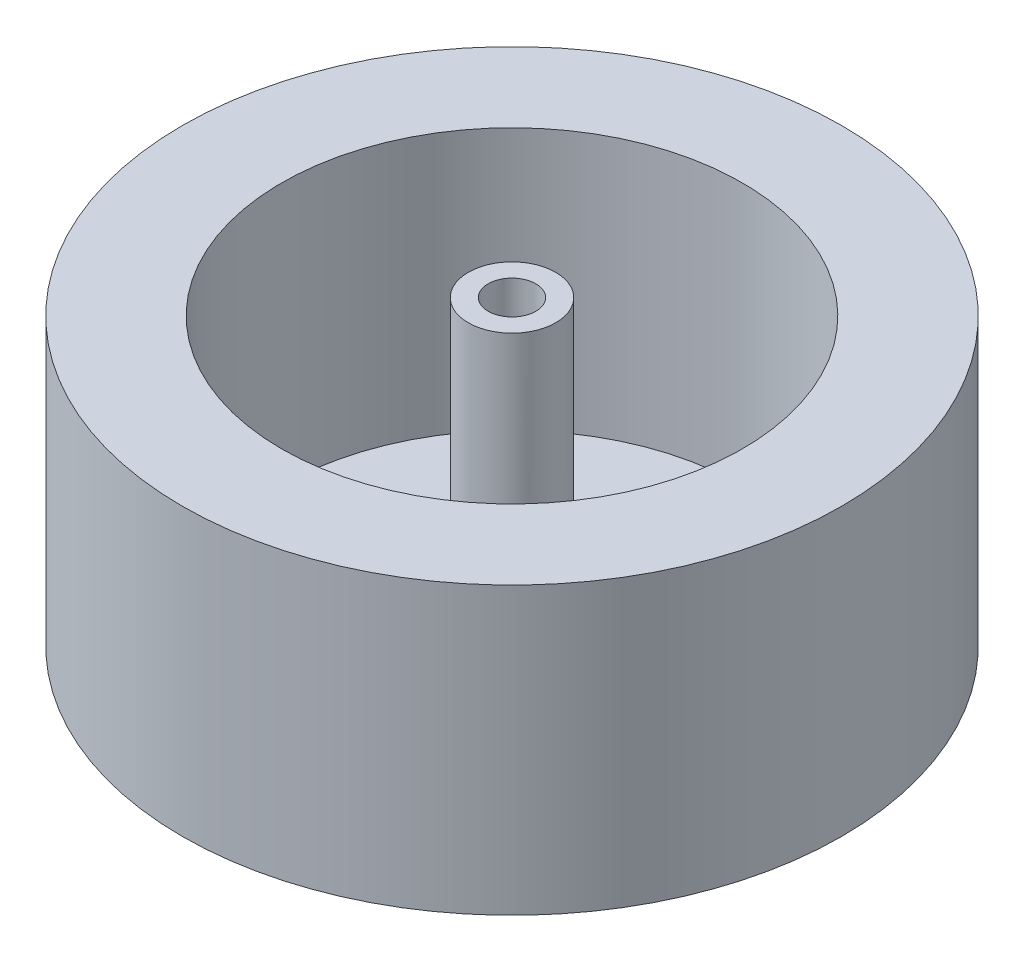
ISO-10303-21;
HEADER;
FILE_DESCRIPTION(('STEP AP214'),'2;1');
FILE_NAME('part.step','',(''),(''),'','','');
FILE_SCHEMA(('AUTOMOTIVE_DESIGN { 1 0 10303 214 1 1 1 1 }'));
ENDSEC;
DATA;
#1=APPLICATION_CONTEXT('core data for automotive mechanical design processes');
#2=APPLICATION_PROTOCOL_DEFINITION('international standard','automotive_design',2000,#1);
#3=PRODUCT_CONTEXT('',#1,'mechanical');
#4=PRODUCT('Part','Part','',(#3));
#5=PRODUCT_RELATED_PRODUCT_CATEGORY('part','',(#4));
#6=PRODUCT_DEFINITION_FORMATION('','',#4);
#7=PRODUCT_DEFINITION_CONTEXT('part definition',#1,'design');
#8=PRODUCT_DEFINITION('design','',#6,#7);
#9=PRODUCT_DEFINITION_SHAPE('','',#8);
#10=(LENGTH_UNIT() NAMED_UNIT(*) SI_UNIT(.MILLI.,.METRE.));
#11=(NAMED_UNIT(*) PLANE_ANGLE_UNIT() SI_UNIT($,.RADIAN.));
#12=(NAMED_UNIT(*) SI_UNIT($,.STERADIAN.) SOLID_ANGLE_UNIT());
#13=UNCERTAINTY_MEASURE_WITH_UNIT(LENGTH_MEASURE(1.E-05),#10,'distance_accuracy_value','');
#14=(GEOMETRIC_REPRESENTATION_CONTEXT(3) GLOBAL_UNCERTAINTY_ASSIGNED_CONTEXT((#13)) GLOBAL_UNIT_ASSIGNED_CONTEXT((#10,
#11,#12)) REPRESENTATION_CONTEXT('',''));
#15=CARTESIAN_POINT('',(0.,0.,0.));
#16=DIRECTION('',(0.,0.,1.));
#17=DIRECTION('',(1.,0.,0.));
#18=AXIS2_PLACEMENT_3D('',#15,#16,#17);
#19=CARTESIAN_POINT('',(0.,0.,0.));
#20=DIRECTION('',(0.,-1.,0.));
#21=DIRECTION('',(0.,0.,-1.));
#22=AXIS2_PLACEMENT_3D('',#19,#20,#21);
#23=PLANE('',#22);
#24=CARTESIAN_POINT('',(0.,0.,0.));
#25=DIRECTION('',(0.,1.,0.));
#26=DIRECTION('',(0.,0.,1.));
#27=AXIS2_PLACEMENT_3D('',#24,#25,#26);
#28=CIRCLE('',#27,2.);
#29=CARTESIAN_POINT('',(0.,0.,2.));
#30=VERTEX_POINT('',#29);
#31=EDGE_CURVE('E70',#30,#30,#28,.T.);
#32=ORIENTED_EDGE('',*,*,#31,.F.);
#33=EDGE_LOOP('',(#32));
#34=FACE_BOUND('',#33,.T.);
#35=CARTESIAN_POINT('',(0.,0.,0.));
#36=DIRECTION('',(0.,1.,0.));
#37=DIRECTION('',(0.,0.,1.));
#38=AXIS2_PLACEMENT_3D('',#35,#36,#37);
#39=CIRCLE('',#38,3.);
#40=CARTESIAN_POINT('',(0.,0.,3.));
#41=VERTEX_POINT('',#40);
#42=EDGE_CURVE('E82',#41,#41,#39,.T.);
#43=ORIENTED_EDGE('',*,*,#42,.T.);
#44=EDGE_LOOP('',(#43));
#45=FACE_BOUND('',#44,.T.);
#46=ADVANCED_FACE('F41',(#34,#45),#23,.F.);
#47=CARTESIAN_POINT('',(0.,33.,0.));
#48=DIRECTION('',(0.,1.,0.));
#49=DIRECTION('',(0.,0.,1.));
#50=AXIS2_PLACEMENT_3D('',#47,#48,#49);
#51=PLANE('',#50);
#52=CARTESIAN_POINT('',(0.,33.,0.));
#53=DIRECTION('',(0.,1.,0.));
#54=DIRECTION('',(0.,0.,1.));
#55=AXIS2_PLACEMENT_3D('',#52,#53,#54);
#56=CIRCLE('',#55,41.5);
#57=CARTESIAN_POINT('',(0.,33.,41.5));
#58=VERTEX_POINT('',#57);
#59=EDGE_CURVE('E49',#58,#58,#56,.T.);
#60=ORIENTED_EDGE('',*,*,#59,.T.);
#61=EDGE_LOOP('',(#60));
#62=FACE_BOUND('',#61,.T.);
#63=CARTESIAN_POINT('',(0.,33.,0.));
#64=DIRECTION('',(0.,1.,0.));
#65=DIRECTION('',(0.,0.,1.));
#66=AXIS2_PLACEMENT_3D('',#63,#64,#65);
#67=CIRCLE('',#66,29.);
#68=CARTESIAN_POINT('',(0.,33.,29.));
#69=VERTEX_POINT('',#68);
#70=EDGE_CURVE('E54',#69,#69,#67,.T.);
#71=ORIENTED_EDGE('',*,*,#70,.F.);
#72=EDGE_LOOP('',(#71));
#73=FACE_BOUND('',#72,.T.);
#74=ADVANCED_FACE('F110',(#62,#73),#51,.T.);
#75=CARTESIAN_POINT('',(0.,33.,0.));
#76=DIRECTION('',(0.,-1.,0.));
#77=DIRECTION('',(0.,0.,-1.));
#78=AXIS2_PLACEMENT_3D('',#75,#76,#77);
#79=CYLINDRICAL_SURFACE('',#78,41.5);
#80=ORIENTED_EDGE('',*,*,#59,.F.);
#81=EDGE_LOOP('',(#80));
#82=FACE_BOUND('',#81,.T.);
#83=CARTESIAN_POINT('',(0.,-3.,0.));
#84=DIRECTION('',(0.,-1.,0.));
#85=DIRECTION('',(0.,0.,-1.));
#86=AXIS2_PLACEMENT_3D('',#83,#84,#85);
#87=CIRCLE('',#86,41.5);
#88=CARTESIAN_POINT('',(0.,-3.,-41.5));
#89=VERTEX_POINT('',#88);
#90=EDGE_CURVE('E64',#89,#89,#87,.T.);
#91=ORIENTED_EDGE('',*,*,#90,.F.);
#92=EDGE_LOOP('',(#91));
#93=FACE_BOUND('',#92,.T.);
#94=ADVANCED_FACE('F43',(#82,#93),#79,.T.);
#95=CARTESIAN_POINT('',(0.,33.,0.));
#96=DIRECTION('',(0.,-1.,0.));
#97=DIRECTION('',(0.,0.,-1.));
#98=AXIS2_PLACEMENT_3D('',#95,#96,#97);
#99=CYLINDRICAL_SURFACE('',#98,29.);
#100=ORIENTED_EDGE('',*,*,#70,.T.);
#101=EDGE_LOOP('',(#100));
#102=FACE_BOUND('',#101,.T.);
#103=CARTESIAN_POINT('',(0.,0.,0.));
#104=DIRECTION('',(0.,1.,0.));
#105=DIRECTION('',(0.,0.,1.));
#106=AXIS2_PLACEMENT_3D('',#103,#104,#105);
#107=CIRCLE('',#106,29.);
#108=CARTESIAN_POINT('',(0.,0.,29.));
#109=VERTEX_POINT('',#108);
#110=EDGE_CURVE('E59',#109,#109,#107,.T.);
#111=ORIENTED_EDGE('',*,*,#110,.F.);
#112=EDGE_LOOP('',(#111));
#113=FACE_BOUND('',#112,.T.);
#114=ADVANCED_FACE('F122',(#102,#113),#99,.F.);
#115=CARTESIAN_POINT('',(0.,0.,0.));
#116=DIRECTION('',(0.,-1.,0.));
#117=DIRECTION('',(0.,0.,-1.));
#118=AXIS2_PLACEMENT_3D('',#115,#116,#117);
#119=CIRCLE('',#118,5.5);
#120=CARTESIAN_POINT('',(0.,0.,-5.5));
#121=VERTEX_POINT('',#120);
#122=EDGE_CURVE('E10',#121,#121,#119,.F.);
#123=ORIENTED_EDGE('',*,*,#122,.F.);
#124=EDGE_LOOP('',(#123));
#125=FACE_BOUND('',#124,.T.);
#126=ORIENTED_EDGE('',*,*,#110,.T.);
#127=EDGE_LOOP('',(#126));
#128=FACE_BOUND('',#127,.T.);
#129=ADVANCED_FACE('F113',(#125,#128),#23,.F.);
#130=CARTESIAN_POINT('',(0.,-3.,0.));
#131=DIRECTION('',(0.,-1.,0.));
#132=DIRECTION('',(0.,0.,-1.));
#133=AXIS2_PLACEMENT_3D('',#130,#131,#132);
#134=PLANE('',#133);
#135=CARTESIAN_POINT('',(0.,-3.,0.));
#136=DIRECTION('',(0.,1.,0.));
#137=DIRECTION('',(0.,0.,1.));
#138=AXIS2_PLACEMENT_3D('',#135,#136,#137);
#139=CIRCLE('',#138,2.);
#140=CARTESIAN_POINT('',(0.,-3.,2.));
#141=VERTEX_POINT('',#140);
#142=EDGE_CURVE('E69',#141,#141,#139,.T.);
#143=ORIENTED_EDGE('',*,*,#142,.T.);
#144=EDGE_LOOP('',(#143));
#145=FACE_BOUND('',#144,.T.);
#146=ORIENTED_EDGE('',*,*,#90,.T.);
#147=EDGE_LOOP('',(#146));
#148=FACE_BOUND('',#147,.T.);
#149=ADVANCED_FACE('F105',(#145,#148),#134,.T.);
#150=CARTESIAN_POINT('',(0.,-3.,0.));
#151=DIRECTION('',(0.,1.,0.));
#152=DIRECTION('',(0.,0.,1.));
#153=AXIS2_PLACEMENT_3D('',#150,#151,#152);
#154=CYLINDRICAL_SURFACE('',#153,2.);
#155=ORIENTED_EDGE('',*,*,#142,.F.);
#156=EDGE_LOOP('',(#155));
#157=FACE_BOUND('',#156,.T.);
#158=ORIENTED_EDGE('',*,*,#31,.T.);
#159=EDGE_LOOP('',(#158));
#160=FACE_BOUND('',#159,.T.);
#161=ADVANCED_FACE('F96',(#157,#160),#154,.F.);
#162=CARTESIAN_POINT('',(0.,35.,0.));
#163=DIRECTION('',(0.,1.,0.));
#164=DIRECTION('',(0.,0.,1.));
#165=AXIS2_PLACEMENT_3D('',#162,#163,#164);
#166=PLANE('',#165);
#167=CARTESIAN_POINT('',(0.,35.,0.));
#168=DIRECTION('',(0.,1.,0.));
#169=DIRECTION('',(0.,0.,1.));
#170=AXIS2_PLACEMENT_3D('',#167,#168,#169);
#171=CIRCLE('',#170,5.5);
#172=CARTESIAN_POINT('',(0.,35.,5.5));
#173=VERTEX_POINT('',#172);
#174=EDGE_CURVE('E74',#173,#173,#171,.T.);
#175=ORIENTED_EDGE('',*,*,#174,.T.);
#176=EDGE_LOOP('',(#175));
#177=FACE_BOUND('',#176,.T.);
#178=CARTESIAN_POINT('',(0.,35.,0.));
#179=DIRECTION('',(0.,1.,0.));
#180=DIRECTION('',(0.,0.,1.));
#181=AXIS2_PLACEMENT_3D('',#178,#179,#180);
#182=CIRCLE('',#181,3.);
#183=CARTESIAN_POINT('',(0.,35.,3.));
#184=VERTEX_POINT('',#183);
#185=EDGE_CURVE('E81',#184,#184,#182,.T.);
#186=ORIENTED_EDGE('',*,*,#185,.F.);
#187=EDGE_LOOP('',(#186));
#188=FACE_BOUND('',#187,.T.);
#189=ADVANCED_FACE('F93',(#177,#188),#166,.T.);
#190=CARTESIAN_POINT('',(0.,35.,0.));
#191=DIRECTION('',(0.,-1.,0.));
#192=DIRECTION('',(0.,0.,-1.));
#193=AXIS2_PLACEMENT_3D('',#190,#191,#192);
#194=CYLINDRICAL_SURFACE('',#193,5.5);
#195=ORIENTED_EDGE('',*,*,#174,.F.);
#196=EDGE_LOOP('',(#195));
#197=FACE_BOUND('',#196,.T.);
#198=ORIENTED_EDGE('',*,*,#122,.T.);
#199=EDGE_LOOP('',(#198));
#200=FACE_BOUND('',#199,.T.);
#201=ADVANCED_FACE('F95',(#197,#200),#194,.T.);
#202=CARTESIAN_POINT('',(0.,35.,0.));
#203=DIRECTION('',(0.,-1.,0.));
#204=DIRECTION('',(0.,0.,-1.));
#205=AXIS2_PLACEMENT_3D('',#202,#203,#204);
#206=CYLINDRICAL_SURFACE('',#205,3.);
#207=ORIENTED_EDGE('',*,*,#185,.T.);
#208=EDGE_LOOP('',(#207));
#209=FACE_BOUND('',#208,.T.);
#210=ORIENTED_EDGE('',*,*,#42,.F.);
#211=EDGE_LOOP('',(#210));
#212=FACE_BOUND('',#211,.T.);
#213=ADVANCED_FACE('F90',(#209,#212),#206,.F.);
#214=CLOSED_SHELL('',(#46,#74,#94,#114,#129,#149,#161,#189,#201,#213));
#215=MANIFOLD_SOLID_BREP('B2',#214);
#216=ADVANCED_BREP_SHAPE_REPRESENTATION('',(#18,#215),#14);
#217=SHAPE_DEFINITION_REPRESENTATION(#9,#216);
ENDSEC;
END-ISO-10303-21;
